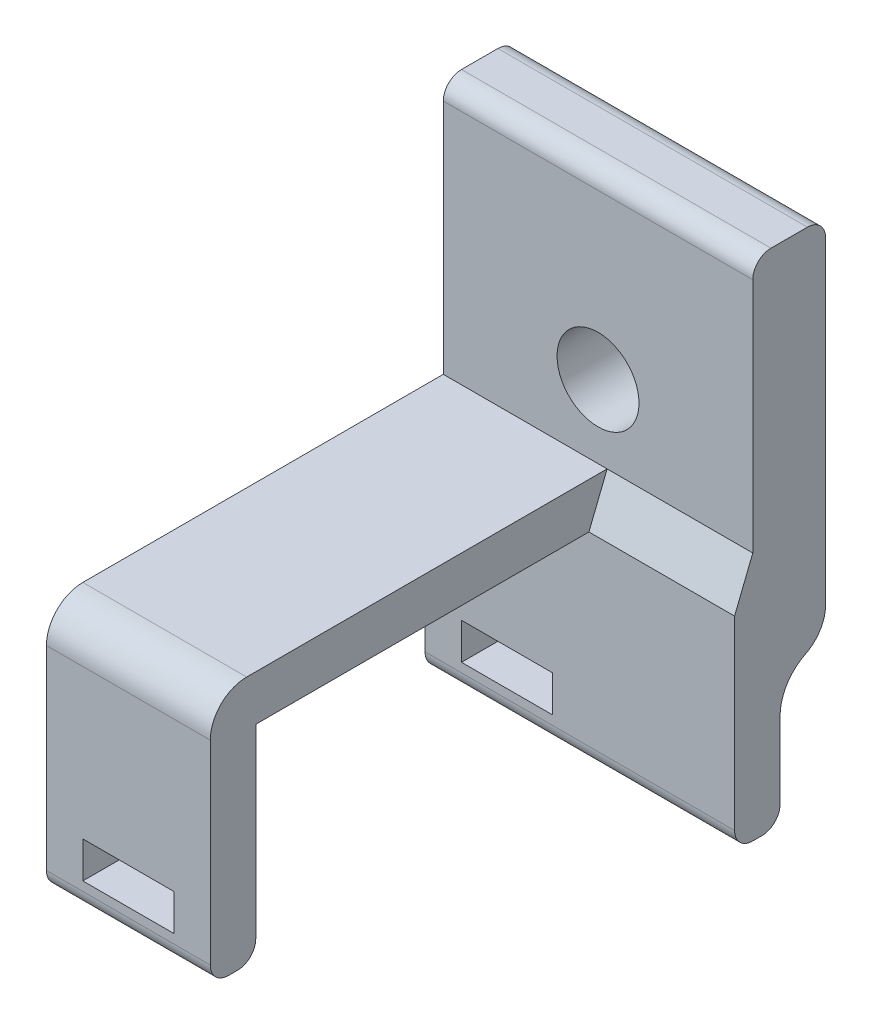
ISO-10303-21;
HEADER;
FILE_DESCRIPTION(('STEP AP214'),'2;1');
FILE_NAME('part.step','',(''),(''),'','','');
FILE_SCHEMA(('AUTOMOTIVE_DESIGN { 1 0 10303 214 1 1 1 1 }'));
ENDSEC;
DATA;
#1=APPLICATION_CONTEXT('core data for automotive mechanical design processes');
#2=APPLICATION_PROTOCOL_DEFINITION('international standard','automotive_design',2000,#1);
#3=PRODUCT_CONTEXT('',#1,'mechanical');
#4=PRODUCT('Part','Part','',(#3));
#5=PRODUCT_RELATED_PRODUCT_CATEGORY('part','',(#4));
#6=PRODUCT_DEFINITION_FORMATION('','',#4);
#7=PRODUCT_DEFINITION_CONTEXT('part definition',#1,'design');
#8=PRODUCT_DEFINITION('design','',#6,#7);
#9=PRODUCT_DEFINITION_SHAPE('','',#8);
#10=(LENGTH_UNIT() NAMED_UNIT(*) SI_UNIT(.MILLI.,.METRE.));
#11=(NAMED_UNIT(*) PLANE_ANGLE_UNIT() SI_UNIT($,.RADIAN.));
#12=(NAMED_UNIT(*) SI_UNIT($,.STERADIAN.) SOLID_ANGLE_UNIT());
#13=UNCERTAINTY_MEASURE_WITH_UNIT(LENGTH_MEASURE(1.E-05),#10,'distance_accuracy_value','');
#14=(GEOMETRIC_REPRESENTATION_CONTEXT(3) GLOBAL_UNCERTAINTY_ASSIGNED_CONTEXT((#13)) GLOBAL_UNIT_ASSIGNED_CONTEXT((#10,
#11,#12)) REPRESENTATION_CONTEXT('',''));
#15=CARTESIAN_POINT('',(0.,0.,0.));
#16=DIRECTION('',(0.,0.,1.));
#17=DIRECTION('',(1.,0.,0.));
#18=AXIS2_PLACEMENT_3D('',#15,#16,#17);
#19=CARTESIAN_POINT('',(4.5,-12.5,0.));
#20=DIRECTION('',(-1.,0.,0.));
#21=DIRECTION('',(0.,0.,1.));
#22=AXIS2_PLACEMENT_3D('',#19,#20,#21);
#23=PLANE('',#22);
#24=DIRECTION('',(0.,0.,1.));
#25=VECTOR('',#24,1.);
#26=CARTESIAN_POINT('',(4.5,-17.7000000177651,13.6433960420964));
#27=LINE('',#26,#25);
#28=CARTESIAN_POINT('',(4.5,-17.7000000177651,24.3000000000104));
#29=VERTEX_POINT('',#28);
#30=CARTESIAN_POINT('',(4.5,-17.7000000177651,24.8000000000104));
#31=VERTEX_POINT('',#30);
#32=EDGE_CURVE('E293',#29,#31,#27,.T.);
#33=ORIENTED_EDGE('',*,*,#32,.F.);
#34=CARTESIAN_POINT('',(4.5,-16.7000000177651,24.3000000000104));
#35=DIRECTION('',(-1.,0.,0.));
#36=DIRECTION('',(0.,0.,1.));
#37=AXIS2_PLACEMENT_3D('',#34,#35,#36);
#38=CIRCLE('',#37,1.);
#39=CARTESIAN_POINT('',(4.5,-16.7000000177651,23.3000000000104));
#40=VERTEX_POINT('',#39);
#41=EDGE_CURVE('E43',#29,#40,#38,.F.);
#42=ORIENTED_EDGE('',*,*,#41,.T.);
#43=DIRECTION('',(0.,1.,0.));
#44=VECTOR('',#43,1.);
#45=CARTESIAN_POINT('',(4.5,-14.2000000177651,23.3000000000104));
#46=LINE('',#45,#44);
#47=CARTESIAN_POINT('',(4.5,-6.50000000000001,23.3000000000104));
#48=VERTEX_POINT('',#47);
#49=EDGE_CURVE('E341',#40,#48,#46,.T.);
#50=ORIENTED_EDGE('',*,*,#49,.T.);
#51=DIRECTION('',(0.,0.,-1.));
#52=VECTOR('',#51,1.);
#53=CARTESIAN_POINT('',(4.5,-6.50000000000001,23.3000000000104));
#54=LINE('',#53,#52);
#55=CARTESIAN_POINT('',(4.5,-6.5,5.));
#56=VERTEX_POINT('',#55);
#57=EDGE_CURVE('E338',#48,#56,#54,.T.);
#58=ORIENTED_EDGE('',*,*,#57,.T.);
#59=DIRECTION('',(0.,-0.928476690885259,0.371390676354104));
#60=VECTOR('',#59,1.);
#61=CARTESIAN_POINT('',(4.5,-4.,4.));
#62=LINE('',#61,#60);
#63=CARTESIAN_POINT('',(4.5,-4.,4.));
#64=VERTEX_POINT('',#63);
#65=EDGE_CURVE('E305',#64,#56,#62,.T.);
#66=ORIENTED_EDGE('',*,*,#65,.F.);
#67=DIRECTION('',(0.,0.,-1.));
#68=VECTOR('',#67,1.);
#69=CARTESIAN_POINT('',(4.5,-4.00000000000001,25.8000000000104));
#70=LINE('',#69,#68);
#71=CARTESIAN_POINT('',(4.5,-4.00000000000001,23.8000000000104));
#72=VERTEX_POINT('',#71);
#73=EDGE_CURVE('E334',#72,#64,#70,.T.);
#74=ORIENTED_EDGE('',*,*,#73,.F.);
#75=CARTESIAN_POINT('',(4.5,-6.00000000000001,23.8000000000104));
#76=DIRECTION('',(-1.,0.,0.));
#77=DIRECTION('',(0.,0.,1.));
#78=AXIS2_PLACEMENT_3D('',#75,#76,#77);
#79=CIRCLE('',#78,2.);
#80=CARTESIAN_POINT('',(4.5,-6.00000000000001,25.8000000000104));
#81=VERTEX_POINT('',#80);
#82=EDGE_CURVE('E387',#72,#81,#79,.F.);
#83=ORIENTED_EDGE('',*,*,#82,.T.);
#84=DIRECTION('',(0.,1.,0.));
#85=VECTOR('',#84,1.);
#86=CARTESIAN_POINT('',(4.5,-14.2000000177651,25.8000000000104));
#87=LINE('',#86,#85);
#88=CARTESIAN_POINT('',(4.5,-16.7000000177651,25.8000000000104));
#89=VERTEX_POINT('',#88);
#90=EDGE_CURVE('E332',#89,#81,#87,.T.);
#91=ORIENTED_EDGE('',*,*,#90,.F.);
#92=CARTESIAN_POINT('',(4.5,-16.7000000177651,24.8000000000104));
#93=DIRECTION('',(-1.,0.,0.));
#94=DIRECTION('',(0.,0.,1.));
#95=AXIS2_PLACEMENT_3D('',#92,#93,#94);
#96=CIRCLE('',#95,1.);
#97=EDGE_CURVE('E50',#89,#31,#96,.F.);
#98=ORIENTED_EDGE('',*,*,#97,.T.);
#99=EDGE_LOOP('',(#33,#42,#50,#58,#66,#74,#83,#91,#98));
#100=FACE_BOUND('',#99,.T.);
#101=ADVANCED_FACE('F35',(#100),#23,.F.);
#102=CARTESIAN_POINT('',(4.5,-14.2000000177651,25.8000000000104));
#103=DIRECTION('',(0.,0.,1.));
#104=DIRECTION('',(0.,-1.,0.));
#105=AXIS2_PLACEMENT_3D('',#102,#103,#104);
#106=PLANE('',#105);
#107=DIRECTION('',(0.,1.,0.));
#108=VECTOR('',#107,1.);
#109=CARTESIAN_POINT('',(2.5,-16.2000000177651,25.8000000000104));
#110=LINE('',#109,#108);
#111=CARTESIAN_POINT('',(2.5,-16.2000000177651,25.8000000000104));
#112=VERTEX_POINT('',#111);
#113=CARTESIAN_POINT('',(2.5,-14.2000000177651,25.8000000000104));
#114=VERTEX_POINT('',#113);
#115=EDGE_CURVE('E248',#112,#114,#110,.T.);
#116=ORIENTED_EDGE('',*,*,#115,.F.);
#117=DIRECTION('',(1.,0.,0.));
#118=VECTOR('',#117,1.);
#119=CARTESIAN_POINT('',(-2.5,-16.2000000177651,25.8000000000104));
#120=LINE('',#119,#118);
#121=CARTESIAN_POINT('',(-2.5,-16.2000000177651,25.8000000000104));
#122=VERTEX_POINT('',#121);
#123=EDGE_CURVE('E253',#122,#112,#120,.T.);
#124=ORIENTED_EDGE('',*,*,#123,.F.);
#125=DIRECTION('',(0.,-1.,0.));
#126=VECTOR('',#125,1.);
#127=CARTESIAN_POINT('',(-2.5,-16.2000000177651,25.8000000000104));
#128=LINE('',#127,#126);
#129=CARTESIAN_POINT('',(-2.5,-14.2000000177651,25.8000000000104));
#130=VERTEX_POINT('',#129);
#131=EDGE_CURVE('E231',#130,#122,#128,.T.);
#132=ORIENTED_EDGE('',*,*,#131,.F.);
#133=DIRECTION('',(-1.,0.,0.));
#134=VECTOR('',#133,1.);
#135=CARTESIAN_POINT('',(-2.5,-14.2000000177651,25.8000000000104));
#136=LINE('',#135,#134);
#137=EDGE_CURVE('E242',#114,#130,#136,.T.);
#138=ORIENTED_EDGE('',*,*,#137,.F.);
#139=EDGE_LOOP('',(#116,#124,#132,#138));
#140=FACE_BOUND('',#139,.T.);
#141=DIRECTION('',(0.,1.,0.));
#142=VECTOR('',#141,1.);
#143=CARTESIAN_POINT('',(-4.5,-14.2000000177651,25.8000000000104));
#144=LINE('',#143,#142);
#145=CARTESIAN_POINT('',(-4.5,-16.7000000177651,25.8000000000104));
#146=VERTEX_POINT('',#145);
#147=CARTESIAN_POINT('',(-4.5,-6.00000000000001,25.8000000000104));
#148=VERTEX_POINT('',#147);
#149=EDGE_CURVE('E331',#146,#148,#144,.T.);
#150=ORIENTED_EDGE('',*,*,#149,.F.);
#151=DIRECTION('',(1.,0.,0.));
#152=VECTOR('',#151,1.);
#153=CARTESIAN_POINT('',(4.5,-16.7000000177651,25.8000000000104));
#154=LINE('',#153,#152);
#155=EDGE_CURVE('E11',#146,#89,#154,.T.);
#156=ORIENTED_EDGE('',*,*,#155,.T.);
#157=ORIENTED_EDGE('',*,*,#90,.T.);
#158=DIRECTION('',(-1.,0.,0.));
#159=VECTOR('',#158,1.);
#160=CARTESIAN_POINT('',(4.5,-6.00000000000001,25.8000000000104));
#161=LINE('',#160,#159);
#162=EDGE_CURVE('E390',#81,#148,#161,.T.);
#163=ORIENTED_EDGE('',*,*,#162,.T.);
#164=EDGE_LOOP('',(#150,#156,#157,#163));
#165=FACE_BOUND('',#164,.T.);
#166=ADVANCED_FACE('F250',(#140,#165),#106,.T.);
#167=CARTESIAN_POINT('',(4.5,-14.2000000177651,23.3000000000104));
#168=DIRECTION('',(0.,0.,1.));
#169=DIRECTION('',(0.,-1.,0.));
#170=AXIS2_PLACEMENT_3D('',#167,#168,#169);
#171=PLANE('',#170);
#172=DIRECTION('',(1.,0.,0.));
#173=VECTOR('',#172,1.);
#174=CARTESIAN_POINT('',(4.5,-16.2000000177651,23.3000000000104));
#175=LINE('',#174,#173);
#176=CARTESIAN_POINT('',(-2.5,-16.2000000177651,23.3000000000104));
#177=VERTEX_POINT('',#176);
#178=CARTESIAN_POINT('',(2.5,-16.2000000177651,23.3000000000104));
#179=VERTEX_POINT('',#178);
#180=EDGE_CURVE('E277',#177,#179,#175,.T.);
#181=ORIENTED_EDGE('',*,*,#180,.T.);
#182=DIRECTION('',(0.,1.,0.));
#183=VECTOR('',#182,1.);
#184=CARTESIAN_POINT('',(2.5,-14.2000000177651,23.3000000000104));
#185=LINE('',#184,#183);
#186=CARTESIAN_POINT('',(2.5,-14.2000000177651,23.3000000000104));
#187=VERTEX_POINT('',#186);
#188=EDGE_CURVE('E283',#179,#187,#185,.T.);
#189=ORIENTED_EDGE('',*,*,#188,.T.);
#190=DIRECTION('',(-1.,0.,0.));
#191=VECTOR('',#190,1.);
#192=CARTESIAN_POINT('',(4.5,-14.2000000177651,23.3000000000104));
#193=LINE('',#192,#191);
#194=CARTESIAN_POINT('',(-2.5,-14.2000000177651,23.3000000000104));
#195=VERTEX_POINT('',#194);
#196=EDGE_CURVE('E268',#187,#195,#193,.T.);
#197=ORIENTED_EDGE('',*,*,#196,.T.);
#198=DIRECTION('',(0.,-1.,0.));
#199=VECTOR('',#198,1.);
#200=CARTESIAN_POINT('',(-2.5,-14.2000000177651,23.3000000000104));
#201=LINE('',#200,#199);
#202=EDGE_CURVE('E234',#195,#177,#201,.T.);
#203=ORIENTED_EDGE('',*,*,#202,.T.);
#204=EDGE_LOOP('',(#181,#189,#197,#203));
#205=FACE_BOUND('',#204,.T.);
#206=ORIENTED_EDGE('',*,*,#49,.F.);
#207=DIRECTION('',(-1.,0.,0.));
#208=VECTOR('',#207,1.);
#209=CARTESIAN_POINT('',(-4.5,-16.7000000177651,23.3000000000104));
#210=LINE('',#209,#208);
#211=CARTESIAN_POINT('',(-4.5,-16.7000000177651,23.3000000000104));
#212=VERTEX_POINT('',#211);
#213=EDGE_CURVE('E449',#40,#212,#210,.T.);
#214=ORIENTED_EDGE('',*,*,#213,.T.);
#215=DIRECTION('',(0.,1.,0.));
#216=VECTOR('',#215,1.);
#217=CARTESIAN_POINT('',(-4.5,-14.2000000177651,23.3000000000104));
#218=LINE('',#217,#216);
#219=CARTESIAN_POINT('',(-4.5,-6.50000000000001,23.3000000000104));
#220=VERTEX_POINT('',#219);
#221=EDGE_CURVE('E335',#212,#220,#218,.T.);
#222=ORIENTED_EDGE('',*,*,#221,.T.);
#223=DIRECTION('',(-1.,0.,0.));
#224=VECTOR('',#223,1.);
#225=CARTESIAN_POINT('',(4.5,-6.50000000000001,23.3000000000104));
#226=LINE('',#225,#224);
#227=EDGE_CURVE('E367',#48,#220,#226,.T.);
#228=ORIENTED_EDGE('',*,*,#227,.F.);
#229=EDGE_LOOP('',(#206,#214,#222,#228));
#230=FACE_BOUND('',#229,.T.);
#231=ADVANCED_FACE('F463',(#205,#230),#171,.F.);
#232=CARTESIAN_POINT('',(4.5,-6.50000000000001,23.3000000000104));
#233=DIRECTION('',(0.,1.,0.));
#234=DIRECTION('',(0.,0.,1.));
#235=AXIS2_PLACEMENT_3D('',#232,#233,#234);
#236=PLANE('',#235);
#237=DIRECTION('',(0.,0.,-1.));
#238=VECTOR('',#237,1.);
#239=CARTESIAN_POINT('',(-4.5,-6.50000000000001,23.3000000000104));
#240=LINE('',#239,#238);
#241=CARTESIAN_POINT('',(-4.5,-6.5,5.));
#242=VERTEX_POINT('',#241);
#243=EDGE_CURVE('E364',#220,#242,#240,.T.);
#244=ORIENTED_EDGE('',*,*,#243,.T.);
#245=DIRECTION('',(-1.,0.,0.));
#246=VECTOR('',#245,1.);
#247=CARTESIAN_POINT('',(4.5,-6.5,5.));
#248=LINE('',#247,#246);
#249=EDGE_CURVE('E371',#56,#242,#248,.T.);
#250=ORIENTED_EDGE('',*,*,#249,.F.);
#251=ORIENTED_EDGE('',*,*,#57,.F.);
#252=ORIENTED_EDGE('',*,*,#227,.T.);
#253=EDGE_LOOP('',(#244,#250,#251,#252));
#254=FACE_BOUND('',#253,.T.);
#255=ADVANCED_FACE('F569',(#254),#236,.F.);
#256=CARTESIAN_POINT('',(4.5,-6.5,5.));
#257=DIRECTION('',(0.,0.,-1.));
#258=DIRECTION('',(0.,1.,0.));
#259=AXIS2_PLACEMENT_3D('',#256,#257,#258);
#260=PLANE('',#259);
#261=DIRECTION('',(1.,0.,0.));
#262=VECTOR('',#261,1.);
#263=CARTESIAN_POINT('',(4.5,-14.2000000177651,5.));
#264=LINE('',#263,#262);
#265=CARTESIAN_POINT('',(-2.5,-14.2000000177651,5.));
#266=VERTEX_POINT('',#265);
#267=CARTESIAN_POINT('',(2.5,-14.2000000177651,5.));
#268=VERTEX_POINT('',#267);
#269=EDGE_CURVE('E265',#266,#268,#264,.T.);
#270=ORIENTED_EDGE('',*,*,#269,.T.);
#271=DIRECTION('',(0.,-1.,0.));
#272=VECTOR('',#271,1.);
#273=CARTESIAN_POINT('',(2.5,-6.5,5.));
#274=LINE('',#273,#272);
#275=CARTESIAN_POINT('',(2.5,-16.2000000177651,5.));
#276=VERTEX_POINT('',#275);
#277=EDGE_CURVE('E280',#268,#276,#274,.T.);
#278=ORIENTED_EDGE('',*,*,#277,.T.);
#279=DIRECTION('',(-1.,0.,0.));
#280=VECTOR('',#279,1.);
#281=CARTESIAN_POINT('',(4.5,-16.2000000177651,5.));
#282=LINE('',#281,#280);
#283=CARTESIAN_POINT('',(-2.5,-16.2000000177651,5.));
#284=VERTEX_POINT('',#283);
#285=EDGE_CURVE('E274',#276,#284,#282,.T.);
#286=ORIENTED_EDGE('',*,*,#285,.T.);
#287=DIRECTION('',(0.,1.,0.));
#288=VECTOR('',#287,1.);
#289=CARTESIAN_POINT('',(-2.5,-6.5,5.));
#290=LINE('',#289,#288);
#291=EDGE_CURVE('E270',#284,#266,#290,.T.);
#292=ORIENTED_EDGE('',*,*,#291,.T.);
#293=EDGE_LOOP('',(#270,#278,#286,#292));
#294=FACE_BOUND('',#293,.T.);
#295=DIRECTION('',(0.,-1.,0.));
#296=VECTOR('',#295,1.);
#297=CARTESIAN_POINT('',(-4.5,-6.5,5.));
#298=LINE('',#297,#296);
#299=CARTESIAN_POINT('',(-4.5,-16.7000000177651,5.));
#300=VERTEX_POINT('',#299);
#301=EDGE_CURVE('E361',#242,#300,#298,.T.);
#302=ORIENTED_EDGE('',*,*,#301,.T.);
#303=DIRECTION('',(1.,0.,0.));
#304=VECTOR('',#303,1.);
#305=CARTESIAN_POINT('',(12.5,-16.7000000177651,5.));
#306=LINE('',#305,#304);
#307=CARTESIAN_POINT('',(12.5,-16.7000000177651,5.));
#308=VERTEX_POINT('',#307);
#309=EDGE_CURVE('E446',#300,#308,#306,.T.);
#310=ORIENTED_EDGE('',*,*,#309,.T.);
#311=DIRECTION('',(0.,-1.,0.));
#312=VECTOR('',#311,1.);
#313=CARTESIAN_POINT('',(12.5,-6.5,5.));
#314=LINE('',#313,#312);
#315=CARTESIAN_POINT('',(12.5,-6.5,5.));
#316=VERTEX_POINT('',#315);
#317=EDGE_CURVE('E315',#316,#308,#314,.T.);
#318=ORIENTED_EDGE('',*,*,#317,.F.);
#319=DIRECTION('',(-1.,0.,0.));
#320=VECTOR('',#319,1.);
#321=CARTESIAN_POINT('',(12.5,-6.5,5.));
#322=LINE('',#321,#320);
#323=EDGE_CURVE('E323',#316,#56,#322,.T.);
#324=ORIENTED_EDGE('',*,*,#323,.T.);
#325=ORIENTED_EDGE('',*,*,#249,.T.);
#326=EDGE_LOOP('',(#302,#310,#318,#324,#325));
#327=FACE_BOUND('',#326,.T.);
#328=ADVANCED_FACE('F510',(#294,#327),#260,.F.);
#329=CARTESIAN_POINT('',(4.5,-14.2000000177651,2.5));
#330=DIRECTION('',(0.,0.,1.));
#331=DIRECTION('',(0.,-1.,0.));
#332=AXIS2_PLACEMENT_3D('',#329,#330,#331);
#333=PLANE('',#332);
#334=DIRECTION('',(1.,0.,0.));
#335=VECTOR('',#334,1.);
#336=CARTESIAN_POINT('',(4.5,-16.2000000177651,2.5));
#337=LINE('',#336,#335);
#338=CARTESIAN_POINT('',(-2.5,-16.2000000177651,2.5));
#339=VERTEX_POINT('',#338);
#340=CARTESIAN_POINT('',(2.5,-16.2000000177651,2.5));
#341=VERTEX_POINT('',#340);
#342=EDGE_CURVE('E403',#339,#341,#337,.T.);
#343=ORIENTED_EDGE('',*,*,#342,.T.);
#344=DIRECTION('',(0.,1.,0.));
#345=VECTOR('',#344,1.);
#346=CARTESIAN_POINT('',(2.5,-14.2000000177651,2.5));
#347=LINE('',#346,#345);
#348=CARTESIAN_POINT('',(2.5,-14.2000000177651,2.5));
#349=VERTEX_POINT('',#348);
#350=EDGE_CURVE('E406',#341,#349,#347,.T.);
#351=ORIENTED_EDGE('',*,*,#350,.T.);
#352=DIRECTION('',(-1.,0.,0.));
#353=VECTOR('',#352,1.);
#354=CARTESIAN_POINT('',(4.5,-14.2000000177651,2.5));
#355=LINE('',#354,#353);
#356=CARTESIAN_POINT('',(-2.5,-14.2000000177651,2.5));
#357=VERTEX_POINT('',#356);
#358=EDGE_CURVE('E395',#349,#357,#355,.T.);
#359=ORIENTED_EDGE('',*,*,#358,.T.);
#360=DIRECTION('',(0.,-1.,0.));
#361=VECTOR('',#360,1.);
#362=CARTESIAN_POINT('',(-2.5,-14.2000000177651,2.5));
#363=LINE('',#362,#361);
#364=EDGE_CURVE('E400',#357,#339,#363,.T.);
#365=ORIENTED_EDGE('',*,*,#364,.T.);
#366=EDGE_LOOP('',(#343,#351,#359,#365));
#367=FACE_BOUND('',#366,.T.);
#368=DIRECTION('',(0.,1.,0.));
#369=VECTOR('',#368,1.);
#370=CARTESIAN_POINT('',(12.5,-14.2000000177651,2.5));
#371=LINE('',#370,#369);
#372=CARTESIAN_POINT('',(12.5,-16.7000000177651,2.5));
#373=VERTEX_POINT('',#372);
#374=CARTESIAN_POINT('',(12.5,-12.5,2.5));
#375=VERTEX_POINT('',#374);
#376=EDGE_CURVE('E318',#373,#375,#371,.T.);
#377=ORIENTED_EDGE('',*,*,#376,.F.);
#378=DIRECTION('',(-1.,0.,0.));
#379=VECTOR('',#378,1.);
#380=CARTESIAN_POINT('',(-4.5,-16.7000000177651,2.5));
#381=LINE('',#380,#379);
#382=CARTESIAN_POINT('',(-4.5,-16.7000000177651,2.5));
#383=VERTEX_POINT('',#382);
#384=EDGE_CURVE('E439',#373,#383,#381,.T.);
#385=ORIENTED_EDGE('',*,*,#384,.T.);
#386=DIRECTION('',(0.,1.,0.));
#387=VECTOR('',#386,1.);
#388=CARTESIAN_POINT('',(-4.5,-14.2000000177651,2.5));
#389=LINE('',#388,#387);
#390=CARTESIAN_POINT('',(-4.5,-12.5,2.5));
#391=VERTEX_POINT('',#390);
#392=EDGE_CURVE('E359',#383,#391,#389,.T.);
#393=ORIENTED_EDGE('',*,*,#392,.T.);
#394=DIRECTION('',(-1.,0.,0.));
#395=VECTOR('',#394,1.);
#396=CARTESIAN_POINT('',(4.5,-12.5,2.5));
#397=LINE('',#396,#395);
#398=EDGE_CURVE('E374',#375,#391,#397,.T.);
#399=ORIENTED_EDGE('',*,*,#398,.F.);
#400=EDGE_LOOP('',(#377,#385,#393,#399));
#401=FACE_BOUND('',#400,.T.);
#402=ADVANCED_FACE('F529',(#367,#401),#333,.F.);
#403=CARTESIAN_POINT('',(4.5,-12.5,0.));
#404=DIRECTION('',(-1.,0.,0.));
#405=DIRECTION('',(0.,0.,1.));
#406=AXIS2_PLACEMENT_3D('',#403,#404,#405);
#407=CYLINDRICAL_SURFACE('',#406,2.5);
#408=CARTESIAN_POINT('',(-4.5,-12.5,0.));
#409=DIRECTION('',(-1.,0.,0.));
#410=DIRECTION('',(0.,0.,1.));
#411=AXIS2_PLACEMENT_3D('',#408,#409,#410);
#412=CIRCLE('',#411,2.5);
#413=CARTESIAN_POINT('',(-4.5,-10.260483958806,1.11111111111111));
#414=VERTEX_POINT('',#413);
#415=EDGE_CURVE('E356',#391,#414,#412,.T.);
#416=ORIENTED_EDGE('',*,*,#415,.T.);
#417=DIRECTION('',(-1.,0.,0.));
#418=VECTOR('',#417,1.);
#419=CARTESIAN_POINT('',(4.5,-10.260483958806,1.11111111111111));
#420=LINE('',#419,#418);
#421=CARTESIAN_POINT('',(12.5,-10.260483958806,1.11111111111111));
#422=VERTEX_POINT('',#421);
#423=EDGE_CURVE('E385',#414,#422,#420,.F.);
#424=ORIENTED_EDGE('',*,*,#423,.T.);
#425=CARTESIAN_POINT('',(12.5,-12.5,0.));
#426=DIRECTION('',(-1.,0.,0.));
#427=DIRECTION('',(0.,0.,-1.));
#428=AXIS2_PLACEMENT_3D('',#425,#426,#427);
#429=CIRCLE('',#428,2.5);
#430=EDGE_CURVE('E320',#375,#422,#429,.T.);
#431=ORIENTED_EDGE('',*,*,#430,.F.);
#432=ORIENTED_EDGE('',*,*,#398,.T.);
#433=EDGE_LOOP('',(#416,#424,#431,#432));
#434=FACE_BOUND('',#433,.T.);
#435=ADVANCED_FACE('F545',(#434),#407,.F.);
#436=CARTESIAN_POINT('',(4.5,-10.,0.));
#437=DIRECTION('',(0.,0.,1.));
#438=DIRECTION('',(1.,0.,0.));
#439=AXIS2_PLACEMENT_3D('',#436,#437,#438);
#440=PLANE('',#439);
#441=CARTESIAN_POINT('',(4.,0.,0.));
#442=DIRECTION('',(0.,0.,-1.));
#443=DIRECTION('',(-1.,0.,0.));
#444=AXIS2_PLACEMENT_3D('',#441,#442,#443);
#445=CIRCLE('',#444,2.24999999999999);
#446=CARTESIAN_POINT('',(1.75000000000001,0.,0.));
#447=VERTEX_POINT('',#446);
#448=EDGE_CURVE('E295',#447,#447,#445,.T.);
#449=ORIENTED_EDGE('',*,*,#448,.F.);
#450=EDGE_LOOP('',(#449));
#451=FACE_BOUND('',#450,.T.);
#452=DIRECTION('',(0.,1.,0.));
#453=VECTOR('',#452,1.);
#454=CARTESIAN_POINT('',(-4.5,-10.,0.));
#455=LINE('',#454,#453);
#456=CARTESIAN_POINT('',(-4.5,-8.46887112585073,0.));
#457=VERTEX_POINT('',#456);
#458=CARTESIAN_POINT('',(-4.5,9.,0.));
#459=VERTEX_POINT('',#458);
#460=EDGE_CURVE('E353',#457,#459,#455,.T.);
#461=ORIENTED_EDGE('',*,*,#460,.T.);
#462=DIRECTION('',(-1.,0.,0.));
#463=VECTOR('',#462,1.);
#464=CARTESIAN_POINT('',(12.5,9.,0.));
#465=LINE('',#464,#463);
#466=CARTESIAN_POINT('',(12.5,9.,0.));
#467=VERTEX_POINT('',#466);
#468=EDGE_CURVE('E426',#459,#467,#465,.F.);
#469=ORIENTED_EDGE('',*,*,#468,.T.);
#470=DIRECTION('',(0.,1.,0.));
#471=VECTOR('',#470,1.);
#472=CARTESIAN_POINT('',(12.5,-8.46887112585073,0.));
#473=LINE('',#472,#471);
#474=CARTESIAN_POINT('',(12.5,-8.46887112585073,0.));
#475=VERTEX_POINT('',#474);
#476=EDGE_CURVE('E304',#475,#467,#473,.T.);
#477=ORIENTED_EDGE('',*,*,#476,.F.);
#478=DIRECTION('',(-1.,0.,0.));
#479=VECTOR('',#478,1.);
#480=CARTESIAN_POINT('',(4.5,-8.46887112585073,0.));
#481=LINE('',#480,#479);
#482=EDGE_CURVE('E370',#475,#457,#481,.T.);
#483=ORIENTED_EDGE('',*,*,#482,.T.);
#484=EDGE_LOOP('',(#461,#469,#477,#483));
#485=FACE_BOUND('',#484,.T.);
#486=ADVANCED_FACE('F540',(#451,#485),#440,.F.);
#487=CARTESIAN_POINT('',(4.5,10.,4.));
#488=DIRECTION('',(0.,1.,0.));
#489=DIRECTION('',(0.,0.,1.));
#490=AXIS2_PLACEMENT_3D('',#487,#488,#489);
#491=PLANE('',#490);
#492=DIRECTION('',(0.,0.,1.));
#493=VECTOR('',#492,1.);
#494=CARTESIAN_POINT('',(12.5,10.,0.));
#495=LINE('',#494,#493);
#496=CARTESIAN_POINT('',(12.5,10.,1.));
#497=VERTEX_POINT('',#496);
#498=CARTESIAN_POINT('',(12.5,10.,3.));
#499=VERTEX_POINT('',#498);
#500=EDGE_CURVE('E308',#497,#499,#495,.T.);
#501=ORIENTED_EDGE('',*,*,#500,.F.);
#502=DIRECTION('',(-1.,0.,0.));
#503=VECTOR('',#502,1.);
#504=CARTESIAN_POINT('',(-4.5,10.,1.));
#505=LINE('',#504,#503);
#506=CARTESIAN_POINT('',(-4.5,10.,1.));
#507=VERTEX_POINT('',#506);
#508=EDGE_CURVE('E411',#497,#507,#505,.T.);
#509=ORIENTED_EDGE('',*,*,#508,.T.);
#510=DIRECTION('',(0.,0.,-1.));
#511=VECTOR('',#510,1.);
#512=CARTESIAN_POINT('',(-4.5,10.,4.));
#513=LINE('',#512,#511);
#514=CARTESIAN_POINT('',(-4.5,10.,3.));
#515=VERTEX_POINT('',#514);
#516=EDGE_CURVE('E350',#515,#507,#513,.T.);
#517=ORIENTED_EDGE('',*,*,#516,.F.);
#518=DIRECTION('',(-1.,0.,0.));
#519=VECTOR('',#518,1.);
#520=CARTESIAN_POINT('',(4.5,10.,3.));
#521=LINE('',#520,#519);
#522=EDGE_CURVE('E409',#515,#499,#521,.F.);
#523=ORIENTED_EDGE('',*,*,#522,.T.);
#524=EDGE_LOOP('',(#501,#509,#517,#523));
#525=FACE_BOUND('',#524,.T.);
#526=ADVANCED_FACE('F497',(#525),#491,.T.);
#527=CARTESIAN_POINT('',(4.5,-4.,4.));
#528=DIRECTION('',(0.,0.,1.));
#529=DIRECTION('',(1.,0.,0.));
#530=AXIS2_PLACEMENT_3D('',#527,#528,#529);
#531=PLANE('',#530);
#532=CARTESIAN_POINT('',(4.,0.,4.));
#533=DIRECTION('',(0.,0.,1.));
#534=DIRECTION('',(1.,0.,0.));
#535=AXIS2_PLACEMENT_3D('',#532,#533,#534);
#536=CIRCLE('',#535,2.24999999999999);
#537=CARTESIAN_POINT('',(6.24999999999999,0.,4.));
#538=VERTEX_POINT('',#537);
#539=EDGE_CURVE('E300',#538,#538,#536,.T.);
#540=ORIENTED_EDGE('',*,*,#539,.F.);
#541=EDGE_LOOP('',(#540));
#542=FACE_BOUND('',#541,.T.);
#543=DIRECTION('',(0.,-1.,0.));
#544=VECTOR('',#543,1.);
#545=CARTESIAN_POINT('',(12.5,10.,4.));
#546=LINE('',#545,#544);
#547=CARTESIAN_POINT('',(12.5,9.,4.));
#548=VERTEX_POINT('',#547);
#549=CARTESIAN_POINT('',(12.5,-4.,4.));
#550=VERTEX_POINT('',#549);
#551=EDGE_CURVE('E311',#548,#550,#546,.T.);
#552=ORIENTED_EDGE('',*,*,#551,.F.);
#553=DIRECTION('',(-1.,0.,0.));
#554=VECTOR('',#553,1.);
#555=CARTESIAN_POINT('',(4.5,9.,4.));
#556=LINE('',#555,#554);
#557=CARTESIAN_POINT('',(-4.5,9.,4.));
#558=VERTEX_POINT('',#557);
#559=EDGE_CURVE('E436',#548,#558,#556,.T.);
#560=ORIENTED_EDGE('',*,*,#559,.T.);
#561=DIRECTION('',(0.,1.,0.));
#562=VECTOR('',#561,1.);
#563=CARTESIAN_POINT('',(-4.5,-4.,4.));
#564=LINE('',#563,#562);
#565=CARTESIAN_POINT('',(-4.5,-4.,4.));
#566=VERTEX_POINT('',#565);
#567=EDGE_CURVE('E347',#566,#558,#564,.T.);
#568=ORIENTED_EDGE('',*,*,#567,.F.);
#569=DIRECTION('',(-1.,0.,0.));
#570=VECTOR('',#569,1.);
#571=CARTESIAN_POINT('',(4.5,-4.,4.));
#572=LINE('',#571,#570);
#573=EDGE_CURVE('E343',#64,#566,#572,.T.);
#574=ORIENTED_EDGE('',*,*,#573,.F.);
#575=DIRECTION('',(-1.,0.,0.));
#576=VECTOR('',#575,1.);
#577=CARTESIAN_POINT('',(12.5,-4.,4.));
#578=LINE('',#577,#576);
#579=EDGE_CURVE('E328',#550,#64,#578,.T.);
#580=ORIENTED_EDGE('',*,*,#579,.F.);
#581=EDGE_LOOP('',(#552,#560,#568,#574,#580));
#582=FACE_BOUND('',#581,.T.);
#583=ADVANCED_FACE('F490',(#542,#582),#531,.T.);
#584=CARTESIAN_POINT('',(4.5,-4.00000000000001,25.8000000000104));
#585=DIRECTION('',(0.,1.,0.));
#586=DIRECTION('',(0.,0.,1.));
#587=AXIS2_PLACEMENT_3D('',#584,#585,#586);
#588=PLANE('',#587);
#589=DIRECTION('',(0.,0.,-1.));
#590=VECTOR('',#589,1.);
#591=CARTESIAN_POINT('',(-4.5,-4.00000000000001,25.8000000000104));
#592=LINE('',#591,#590);
#593=CARTESIAN_POINT('',(-4.5,-4.00000000000001,23.8000000000104));
#594=VERTEX_POINT('',#593);
#595=EDGE_CURVE('E345',#594,#566,#592,.T.);
#596=ORIENTED_EDGE('',*,*,#595,.F.);
#597=DIRECTION('',(-1.,0.,0.));
#598=VECTOR('',#597,1.);
#599=CARTESIAN_POINT('',(4.5,-4.00000000000001,23.8000000000104));
#600=LINE('',#599,#598);
#601=EDGE_CURVE('E393',#594,#72,#600,.F.);
#602=ORIENTED_EDGE('',*,*,#601,.T.);
#603=ORIENTED_EDGE('',*,*,#73,.T.);
#604=ORIENTED_EDGE('',*,*,#573,.T.);
#605=EDGE_LOOP('',(#596,#602,#603,#604));
#606=FACE_BOUND('',#605,.T.);
#607=ADVANCED_FACE('F483',(#606),#588,.T.);
#608=CARTESIAN_POINT('',(-4.5,-12.5,0.));
#609=DIRECTION('',(-1.,0.,0.));
#610=DIRECTION('',(0.,0.,1.));
#611=AXIS2_PLACEMENT_3D('',#608,#609,#610);
#612=PLANE('',#611);
#613=ORIENTED_EDGE('',*,*,#516,.T.);
#614=CARTESIAN_POINT('',(-4.5,9.,1.));
#615=DIRECTION('',(-1.,0.,0.));
#616=DIRECTION('',(0.,0.,1.));
#617=AXIS2_PLACEMENT_3D('',#614,#615,#616);
#618=CIRCLE('',#617,1.);
#619=EDGE_CURVE('E424',#507,#459,#618,.T.);
#620=ORIENTED_EDGE('',*,*,#619,.T.);
#621=ORIENTED_EDGE('',*,*,#460,.F.);
#622=CARTESIAN_POINT('',(-4.5,-8.46887112585073,2.));
#623=DIRECTION('',(-1.,0.,0.));
#624=DIRECTION('',(0.,0.,1.));
#625=AXIS2_PLACEMENT_3D('',#622,#623,#624);
#626=CIRCLE('',#625,2.);
#627=EDGE_CURVE('E383',#457,#414,#626,.T.);
#628=ORIENTED_EDGE('',*,*,#627,.T.);
#629=ORIENTED_EDGE('',*,*,#415,.F.);
#630=ORIENTED_EDGE('',*,*,#392,.F.);
#631=CARTESIAN_POINT('',(-4.5,-16.7000000177651,3.5));
#632=DIRECTION('',(-1.,0.,0.));
#633=DIRECTION('',(0.,0.,1.));
#634=AXIS2_PLACEMENT_3D('',#631,#632,#633);
#635=CIRCLE('',#634,1.);
#636=CARTESIAN_POINT('',(-4.5,-17.7000000177651,3.49999999999999));
#637=VERTEX_POINT('',#636);
#638=EDGE_CURVE('E420',#383,#637,#635,.T.);
#639=ORIENTED_EDGE('',*,*,#638,.T.);
#640=DIRECTION('',(0.,0.,1.));
#641=VECTOR('',#640,1.);
#642=CARTESIAN_POINT('',(-4.5,-17.7000000177651,-14.8565549577098));
#643=LINE('',#642,#641);
#644=CARTESIAN_POINT('',(-4.5,-17.7000000177651,3.99999999999999));
#645=VERTEX_POINT('',#644);
#646=EDGE_CURVE('E286',#637,#645,#643,.T.);
#647=ORIENTED_EDGE('',*,*,#646,.T.);
#648=CARTESIAN_POINT('',(-4.5,-16.7000000177651,4.));
#649=DIRECTION('',(-1.,0.,0.));
#650=DIRECTION('',(0.,0.,1.));
#651=AXIS2_PLACEMENT_3D('',#648,#649,#650);
#652=CIRCLE('',#651,1.);
#653=EDGE_CURVE('E418',#645,#300,#652,.T.);
#654=ORIENTED_EDGE('',*,*,#653,.T.);
#655=ORIENTED_EDGE('',*,*,#301,.F.);
#656=ORIENTED_EDGE('',*,*,#243,.F.);
#657=ORIENTED_EDGE('',*,*,#221,.F.);
#658=CARTESIAN_POINT('',(-4.5,-16.7000000177651,24.3000000000104));
#659=DIRECTION('',(-1.,0.,0.));
#660=DIRECTION('',(0.,0.,1.));
#661=AXIS2_PLACEMENT_3D('',#658,#659,#660);
#662=CIRCLE('',#661,1.);
#663=CARTESIAN_POINT('',(-4.5,-17.7000000177651,24.3000000000104));
#664=VERTEX_POINT('',#663);
#665=EDGE_CURVE('E416',#212,#664,#662,.T.);
#666=ORIENTED_EDGE('',*,*,#665,.T.);
#667=DIRECTION('',(0.,0.,1.));
#668=VECTOR('',#667,1.);
#669=CARTESIAN_POINT('',(-4.5,-17.7000000177651,13.6433960420964));
#670=LINE('',#669,#668);
#671=CARTESIAN_POINT('',(-4.5,-17.7000000177651,24.8000000000104));
#672=VERTEX_POINT('',#671);
#673=EDGE_CURVE('E290',#664,#672,#670,.T.);
#674=ORIENTED_EDGE('',*,*,#673,.T.);
#675=CARTESIAN_POINT('',(-4.5,-16.7000000177651,24.8000000000104));
#676=DIRECTION('',(-1.,0.,0.));
#677=DIRECTION('',(0.,0.,1.));
#678=AXIS2_PLACEMENT_3D('',#675,#676,#677);
#679=CIRCLE('',#678,1.);
#680=EDGE_CURVE('E414',#672,#146,#679,.T.);
#681=ORIENTED_EDGE('',*,*,#680,.T.);
#682=ORIENTED_EDGE('',*,*,#149,.T.);
#683=CARTESIAN_POINT('',(-4.5,-6.00000000000001,23.8000000000104));
#684=DIRECTION('',(-1.,0.,0.));
#685=DIRECTION('',(0.,0.,1.));
#686=AXIS2_PLACEMENT_3D('',#683,#684,#685);
#687=CIRCLE('',#686,2.);
#688=EDGE_CURVE('E381',#148,#594,#687,.T.);
#689=ORIENTED_EDGE('',*,*,#688,.T.);
#690=ORIENTED_EDGE('',*,*,#595,.T.);
#691=ORIENTED_EDGE('',*,*,#567,.T.);
#692=CARTESIAN_POINT('',(-4.5,9.,3.));
#693=DIRECTION('',(-1.,0.,0.));
#694=DIRECTION('',(0.,0.,1.));
#695=AXIS2_PLACEMENT_3D('',#692,#693,#694);
#696=CIRCLE('',#695,1.);
#697=EDGE_CURVE('E422',#558,#515,#696,.T.);
#698=ORIENTED_EDGE('',*,*,#697,.T.);
#699=EDGE_LOOP('',(#613,#620,#621,#628,#629,#630,#639,#647,#654,#655,#656,#657,#666,#674,#681,
#682,#689,#690,#691,#698));
#700=FACE_BOUND('',#699,.T.);
#701=ADVANCED_FACE('F469',(#700),#612,.T.);
#702=CARTESIAN_POINT('',(4.5,-8.46887112585073,2.));
#703=DIRECTION('',(-1.,0.,0.));
#704=DIRECTION('',(0.,0.,1.));
#705=AXIS2_PLACEMENT_3D('',#702,#703,#704);
#706=CYLINDRICAL_SURFACE('',#705,2.);
#707=ORIENTED_EDGE('',*,*,#482,.F.);
#708=CARTESIAN_POINT('',(12.5,-8.46887112585073,2.));
#709=DIRECTION('',(1.,0.,0.));
#710=DIRECTION('',(0.,0.,-1.));
#711=AXIS2_PLACEMENT_3D('',#708,#709,#710);
#712=CIRCLE('',#711,2.);
#713=EDGE_CURVE('E301',#422,#475,#712,.T.);
#714=ORIENTED_EDGE('',*,*,#713,.F.);
#715=ORIENTED_EDGE('',*,*,#423,.F.);
#716=ORIENTED_EDGE('',*,*,#627,.F.);
#717=EDGE_LOOP('',(#707,#714,#715,#716));
#718=FACE_BOUND('',#717,.T.);
#719=ADVANCED_FACE('F536',(#718),#706,.T.);
#720=CARTESIAN_POINT('',(4.5,-6.00000000000001,23.8000000000104));
#721=DIRECTION('',(-1.,0.,0.));
#722=DIRECTION('',(0.,0.,1.));
#723=AXIS2_PLACEMENT_3D('',#720,#721,#722);
#724=CYLINDRICAL_SURFACE('',#723,2.);
#725=ORIENTED_EDGE('',*,*,#82,.F.);
#726=ORIENTED_EDGE('',*,*,#601,.F.);
#727=ORIENTED_EDGE('',*,*,#688,.F.);
#728=ORIENTED_EDGE('',*,*,#162,.F.);
#729=EDGE_LOOP('',(#725,#726,#727,#728));
#730=FACE_BOUND('',#729,.T.);
#731=ADVANCED_FACE('F479',(#730),#724,.T.);
#732=CARTESIAN_POINT('',(12.5,-4.,4.));
#733=DIRECTION('',(0.,-0.371390676354104,-0.928476690885259));
#734=DIRECTION('',(0.,0.928476690885259,-0.371390676354104));
#735=AXIS2_PLACEMENT_3D('',#732,#733,#734);
#736=PLANE('',#735);
#737=ORIENTED_EDGE('',*,*,#65,.T.);
#738=ORIENTED_EDGE('',*,*,#323,.F.);
#739=DIRECTION('',(0.,-0.928476690885259,0.371390676354104));
#740=VECTOR('',#739,1.);
#741=CARTESIAN_POINT('',(12.5,-4.,4.));
#742=LINE('',#741,#740);
#743=EDGE_CURVE('E313',#550,#316,#742,.T.);
#744=ORIENTED_EDGE('',*,*,#743,.F.);
#745=ORIENTED_EDGE('',*,*,#579,.T.);
#746=EDGE_LOOP('',(#737,#738,#744,#745));
#747=FACE_BOUND('',#746,.T.);
#748=ADVANCED_FACE('F506',(#747),#736,.F.);
#749=CARTESIAN_POINT('',(12.5,-8.46887112585073,2.));
#750=DIRECTION('',(1.,0.,0.));
#751=DIRECTION('',(0.,0.,-1.));
#752=AXIS2_PLACEMENT_3D('',#749,#750,#751);
#753=PLANE('',#752);
#754=ORIENTED_EDGE('',*,*,#476,.T.);
#755=CARTESIAN_POINT('',(12.5,9.,1.));
#756=DIRECTION('',(1.,0.,0.));
#757=DIRECTION('',(0.,0.,-1.));
#758=AXIS2_PLACEMENT_3D('',#755,#756,#757);
#759=CIRCLE('',#758,1.);
#760=EDGE_CURVE('E434',#467,#497,#759,.T.);
#761=ORIENTED_EDGE('',*,*,#760,.T.);
#762=ORIENTED_EDGE('',*,*,#500,.T.);
#763=CARTESIAN_POINT('',(12.5,9.,3.));
#764=DIRECTION('',(1.,0.,0.));
#765=DIRECTION('',(0.,0.,-1.));
#766=AXIS2_PLACEMENT_3D('',#763,#764,#765);
#767=CIRCLE('',#766,1.);
#768=EDGE_CURVE('E432',#499,#548,#767,.T.);
#769=ORIENTED_EDGE('',*,*,#768,.T.);
#770=ORIENTED_EDGE('',*,*,#551,.T.);
#771=ORIENTED_EDGE('',*,*,#743,.T.);
#772=ORIENTED_EDGE('',*,*,#317,.T.);
#773=CARTESIAN_POINT('',(12.5,-16.7000000177651,4.));
#774=DIRECTION('',(1.,0.,0.));
#775=DIRECTION('',(0.,0.,-1.));
#776=AXIS2_PLACEMENT_3D('',#773,#774,#775);
#777=CIRCLE('',#776,1.);
#778=CARTESIAN_POINT('',(12.5,-17.7000000177651,3.99999999999999));
#779=VERTEX_POINT('',#778);
#780=EDGE_CURVE('E428',#308,#779,#777,.T.);
#781=ORIENTED_EDGE('',*,*,#780,.T.);
#782=DIRECTION('',(0.,0.,1.));
#783=VECTOR('',#782,1.);
#784=CARTESIAN_POINT('',(12.5,-17.7000000177651,-14.8565549577098));
#785=LINE('',#784,#783);
#786=CARTESIAN_POINT('',(12.5,-17.7000000177651,3.49999999999999));
#787=VERTEX_POINT('',#786);
#788=EDGE_CURVE('E287',#787,#779,#785,.T.);
#789=ORIENTED_EDGE('',*,*,#788,.F.);
#790=CARTESIAN_POINT('',(12.5,-16.7000000177651,3.5));
#791=DIRECTION('',(1.,0.,0.));
#792=DIRECTION('',(0.,0.,-1.));
#793=AXIS2_PLACEMENT_3D('',#790,#791,#792);
#794=CIRCLE('',#793,1.);
#795=EDGE_CURVE('E430',#787,#373,#794,.T.);
#796=ORIENTED_EDGE('',*,*,#795,.T.);
#797=ORIENTED_EDGE('',*,*,#376,.T.);
#798=ORIENTED_EDGE('',*,*,#430,.T.);
#799=ORIENTED_EDGE('',*,*,#713,.T.);
#800=EDGE_LOOP('',(#754,#761,#762,#769,#770,#771,#772,#781,#789,#796,#797,#798,#799));
#801=FACE_BOUND('',#800,.T.);
#802=ADVANCED_FACE('F502',(#801),#753,.T.);
#803=CARTESIAN_POINT('',(4.,0.,0.));
#804=DIRECTION('',(0.,0.,-1.));
#805=DIRECTION('',(-1.,0.,0.));
#806=AXIS2_PLACEMENT_3D('',#803,#804,#805);
#807=CYLINDRICAL_SURFACE('',#806,2.24999999999999);
#808=ORIENTED_EDGE('',*,*,#539,.T.);
#809=EDGE_LOOP('',(#808));
#810=FACE_BOUND('',#809,.T.);
#811=ORIENTED_EDGE('',*,*,#448,.T.);
#812=EDGE_LOOP('',(#811));
#813=FACE_BOUND('',#812,.T.);
#814=ADVANCED_FACE('F620',(#810,#813),#807,.F.);
#815=CARTESIAN_POINT('',(-4.5,-17.7000000177651,13.6433960420964));
#816=DIRECTION('',(0.,-1.,0.));
#817=DIRECTION('',(0.,0.,-1.));
#818=AXIS2_PLACEMENT_3D('',#815,#816,#817);
#819=PLANE('',#818);
#820=ORIENTED_EDGE('',*,*,#673,.F.);
#821=DIRECTION('',(-1.,0.,0.));
#822=VECTOR('',#821,1.);
#823=CARTESIAN_POINT('',(4.5,-17.7000000177651,24.3000000000104));
#824=LINE('',#823,#822);
#825=EDGE_CURVE('E454',#664,#29,#824,.F.);
#826=ORIENTED_EDGE('',*,*,#825,.T.);
#827=ORIENTED_EDGE('',*,*,#32,.T.);
#828=DIRECTION('',(1.,0.,0.));
#829=VECTOR('',#828,1.);
#830=CARTESIAN_POINT('',(-4.5,-17.7000000177651,24.8000000000104));
#831=LINE('',#830,#829);
#832=EDGE_CURVE('E452',#31,#672,#831,.F.);
#833=ORIENTED_EDGE('',*,*,#832,.T.);
#834=EDGE_LOOP('',(#820,#826,#827,#833));
#835=FACE_BOUND('',#834,.T.);
#836=ADVANCED_FACE('F473',(#835),#819,.T.);
#837=CARTESIAN_POINT('',(-4.5,-17.7000000177651,-14.8565549577098));
#838=DIRECTION('',(0.,-1.,0.));
#839=DIRECTION('',(0.,0.,-1.));
#840=AXIS2_PLACEMENT_3D('',#837,#838,#839);
#841=PLANE('',#840);
#842=ORIENTED_EDGE('',*,*,#646,.F.);
#843=DIRECTION('',(-1.,0.,0.));
#844=VECTOR('',#843,1.);
#845=CARTESIAN_POINT('',(12.5,-17.7000000177651,3.5));
#846=LINE('',#845,#844);
#847=EDGE_CURVE('E444',#637,#787,#846,.F.);
#848=ORIENTED_EDGE('',*,*,#847,.T.);
#849=ORIENTED_EDGE('',*,*,#788,.T.);
#850=DIRECTION('',(1.,0.,0.));
#851=VECTOR('',#850,1.);
#852=CARTESIAN_POINT('',(-4.5,-17.7000000177651,4.));
#853=LINE('',#852,#851);
#854=EDGE_CURVE('E442',#779,#645,#853,.F.);
#855=ORIENTED_EDGE('',*,*,#854,.T.);
#856=EDGE_LOOP('',(#842,#848,#849,#855));
#857=FACE_BOUND('',#856,.T.);
#858=ADVANCED_FACE('F519',(#857),#841,.T.);
#859=CARTESIAN_POINT('',(-2.5,-14.2000000177651,0.));
#860=DIRECTION('',(0.,1.,0.));
#861=DIRECTION('',(0.,0.,1.));
#862=AXIS2_PLACEMENT_3D('',#859,#860,#861);
#863=PLANE('',#862);
#864=DIRECTION('',(0.,0.,1.));
#865=VECTOR('',#864,1.);
#866=CARTESIAN_POINT('',(-2.5,-14.2000000177651,0.));
#867=LINE('',#866,#865);
#868=EDGE_CURVE('E237',#357,#266,#867,.T.);
#869=ORIENTED_EDGE('',*,*,#868,.F.);
#870=ORIENTED_EDGE('',*,*,#358,.F.);
#871=DIRECTION('',(0.,0.,1.));
#872=VECTOR('',#871,1.);
#873=CARTESIAN_POINT('',(2.5,-14.2000000177651,0.));
#874=LINE('',#873,#872);
#875=EDGE_CURVE('E238',#349,#268,#874,.T.);
#876=ORIENTED_EDGE('',*,*,#875,.T.);
#877=ORIENTED_EDGE('',*,*,#269,.F.);
#878=EDGE_LOOP('',(#869,#870,#876,#877));
#879=FACE_BOUND('',#878,.T.);
#880=ADVANCED_FACE('F581',(#879),#863,.F.);
#881=CARTESIAN_POINT('',(-2.5,-16.2000000177651,0.));
#882=DIRECTION('',(-1.,0.,0.));
#883=DIRECTION('',(0.,0.,1.));
#884=AXIS2_PLACEMENT_3D('',#881,#882,#883);
#885=PLANE('',#884);
#886=DIRECTION('',(0.,0.,1.));
#887=VECTOR('',#886,1.);
#888=CARTESIAN_POINT('',(-2.5,-16.2000000177651,0.));
#889=LINE('',#888,#887);
#890=EDGE_CURVE('E261',#339,#284,#889,.T.);
#891=ORIENTED_EDGE('',*,*,#890,.F.);
#892=ORIENTED_EDGE('',*,*,#364,.F.);
#893=ORIENTED_EDGE('',*,*,#868,.T.);
#894=ORIENTED_EDGE('',*,*,#291,.F.);
#895=EDGE_LOOP('',(#891,#892,#893,#894));
#896=FACE_BOUND('',#895,.T.);
#897=ADVANCED_FACE('F586',(#896),#885,.F.);
#898=CARTESIAN_POINT('',(-2.5,-16.2000000177651,0.));
#899=DIRECTION('',(0.,-1.,0.));
#900=DIRECTION('',(0.,0.,-1.));
#901=AXIS2_PLACEMENT_3D('',#898,#899,#900);
#902=PLANE('',#901);
#903=DIRECTION('',(0.,0.,1.));
#904=VECTOR('',#903,1.);
#905=CARTESIAN_POINT('',(2.5,-16.2000000177651,0.));
#906=LINE('',#905,#904);
#907=EDGE_CURVE('E260',#341,#276,#906,.T.);
#908=ORIENTED_EDGE('',*,*,#907,.F.);
#909=ORIENTED_EDGE('',*,*,#342,.F.);
#910=ORIENTED_EDGE('',*,*,#890,.T.);
#911=ORIENTED_EDGE('',*,*,#285,.F.);
#912=EDGE_LOOP('',(#908,#909,#910,#911));
#913=FACE_BOUND('',#912,.T.);
#914=ADVANCED_FACE('F593',(#913),#902,.F.);
#915=CARTESIAN_POINT('',(2.5,-16.2000000177651,0.));
#916=DIRECTION('',(1.,0.,0.));
#917=DIRECTION('',(0.,0.,-1.));
#918=AXIS2_PLACEMENT_3D('',#915,#916,#917);
#919=PLANE('',#918);
#920=ORIENTED_EDGE('',*,*,#875,.F.);
#921=ORIENTED_EDGE('',*,*,#350,.F.);
#922=ORIENTED_EDGE('',*,*,#907,.T.);
#923=ORIENTED_EDGE('',*,*,#277,.F.);
#924=EDGE_LOOP('',(#920,#921,#922,#923));
#925=FACE_BOUND('',#924,.T.);
#926=ADVANCED_FACE('F589',(#925),#919,.F.);
#927=EDGE_CURVE('E258',#179,#112,#906,.T.);
#928=ORIENTED_EDGE('',*,*,#927,.T.);
#929=ORIENTED_EDGE('',*,*,#115,.T.);
#930=EDGE_CURVE('E245',#187,#114,#874,.T.);
#931=ORIENTED_EDGE('',*,*,#930,.F.);
#932=ORIENTED_EDGE('',*,*,#188,.F.);
#933=EDGE_LOOP('',(#928,#929,#931,#932));
#934=FACE_BOUND('',#933,.T.);
#935=ADVANCED_FACE('F601',(#934),#919,.F.);
#936=EDGE_CURVE('E262',#177,#122,#889,.T.);
#937=ORIENTED_EDGE('',*,*,#936,.T.);
#938=ORIENTED_EDGE('',*,*,#123,.T.);
#939=ORIENTED_EDGE('',*,*,#927,.F.);
#940=ORIENTED_EDGE('',*,*,#180,.F.);
#941=EDGE_LOOP('',(#937,#938,#939,#940));
#942=FACE_BOUND('',#941,.T.);
#943=ADVANCED_FACE('F596',(#942),#902,.F.);
#944=EDGE_CURVE('E226',#195,#130,#867,.T.);
#945=ORIENTED_EDGE('',*,*,#944,.T.);
#946=ORIENTED_EDGE('',*,*,#131,.T.);
#947=ORIENTED_EDGE('',*,*,#936,.F.);
#948=ORIENTED_EDGE('',*,*,#202,.F.);
#949=EDGE_LOOP('',(#945,#946,#947,#948));
#950=FACE_BOUND('',#949,.T.);
#951=ADVANCED_FACE('F228',(#950),#885,.F.);
#952=ORIENTED_EDGE('',*,*,#930,.T.);
#953=ORIENTED_EDGE('',*,*,#137,.T.);
#954=ORIENTED_EDGE('',*,*,#944,.F.);
#955=ORIENTED_EDGE('',*,*,#196,.F.);
#956=EDGE_LOOP('',(#952,#953,#954,#955));
#957=FACE_BOUND('',#956,.T.);
#958=ADVANCED_FACE('F243',(#957),#863,.F.);
#959=CARTESIAN_POINT('',(4.5,9.,1.));
#960=DIRECTION('',(1.,0.,0.));
#961=DIRECTION('',(0.,0.,-1.));
#962=AXIS2_PLACEMENT_3D('',#959,#960,#961);
#963=CYLINDRICAL_SURFACE('',#962,1.);
#964=ORIENTED_EDGE('',*,*,#760,.F.);
#965=ORIENTED_EDGE('',*,*,#468,.F.);
#966=ORIENTED_EDGE('',*,*,#619,.F.);
#967=ORIENTED_EDGE('',*,*,#508,.F.);
#968=EDGE_LOOP('',(#964,#965,#966,#967));
#969=FACE_BOUND('',#968,.T.);
#970=ADVANCED_FACE('F544',(#969),#963,.T.);
#971=CARTESIAN_POINT('',(4.5,9.,3.));
#972=DIRECTION('',(-1.,0.,0.));
#973=DIRECTION('',(0.,0.,1.));
#974=AXIS2_PLACEMENT_3D('',#971,#972,#973);
#975=CYLINDRICAL_SURFACE('',#974,1.);
#976=ORIENTED_EDGE('',*,*,#768,.F.);
#977=ORIENTED_EDGE('',*,*,#522,.F.);
#978=ORIENTED_EDGE('',*,*,#697,.F.);
#979=ORIENTED_EDGE('',*,*,#559,.F.);
#980=EDGE_LOOP('',(#976,#977,#978,#979));
#981=FACE_BOUND('',#980,.T.);
#982=ADVANCED_FACE('F500',(#981),#975,.T.);
#983=CARTESIAN_POINT('',(4.5,-16.7000000177651,3.5));
#984=DIRECTION('',(1.,0.,0.));
#985=DIRECTION('',(0.,0.,-1.));
#986=AXIS2_PLACEMENT_3D('',#983,#984,#985);
#987=CYLINDRICAL_SURFACE('',#986,1.);
#988=ORIENTED_EDGE('',*,*,#795,.F.);
#989=ORIENTED_EDGE('',*,*,#847,.F.);
#990=ORIENTED_EDGE('',*,*,#638,.F.);
#991=ORIENTED_EDGE('',*,*,#384,.F.);
#992=EDGE_LOOP('',(#988,#989,#990,#991));
#993=FACE_BOUND('',#992,.T.);
#994=ADVANCED_FACE('F526',(#993),#987,.T.);
#995=CARTESIAN_POINT('',(4.5,-16.7000000177651,4.));
#996=DIRECTION('',(-1.,0.,0.));
#997=DIRECTION('',(0.,0.,1.));
#998=AXIS2_PLACEMENT_3D('',#995,#996,#997);
#999=CYLINDRICAL_SURFACE('',#998,1.);
#1000=ORIENTED_EDGE('',*,*,#653,.F.);
#1001=ORIENTED_EDGE('',*,*,#854,.F.);
#1002=ORIENTED_EDGE('',*,*,#780,.F.);
#1003=ORIENTED_EDGE('',*,*,#309,.F.);
#1004=EDGE_LOOP('',(#1000,#1001,#1002,#1003));
#1005=FACE_BOUND('',#1004,.T.);
#1006=ADVANCED_FACE('F515',(#1005),#999,.T.);
#1007=CARTESIAN_POINT('',(4.5,-16.7000000177651,24.3000000000104));
#1008=DIRECTION('',(1.,0.,0.));
#1009=DIRECTION('',(0.,0.,-1.));
#1010=AXIS2_PLACEMENT_3D('',#1007,#1008,#1009);
#1011=CYLINDRICAL_SURFACE('',#1010,1.);
#1012=ORIENTED_EDGE('',*,*,#41,.F.);
#1013=ORIENTED_EDGE('',*,*,#825,.F.);
#1014=ORIENTED_EDGE('',*,*,#665,.F.);
#1015=ORIENTED_EDGE('',*,*,#213,.F.);
#1016=EDGE_LOOP('',(#1012,#1013,#1014,#1015));
#1017=FACE_BOUND('',#1016,.T.);
#1018=ADVANCED_FACE('F466',(#1017),#1011,.T.);
#1019=CARTESIAN_POINT('',(4.5,-16.7000000177651,24.8000000000104));
#1020=DIRECTION('',(1.,0.,0.));
#1021=DIRECTION('',(0.,0.,-1.));
#1022=AXIS2_PLACEMENT_3D('',#1019,#1020,#1021);
#1023=CYLINDRICAL_SURFACE('',#1022,1.);
#1024=ORIENTED_EDGE('',*,*,#680,.F.);
#1025=ORIENTED_EDGE('',*,*,#832,.F.);
#1026=ORIENTED_EDGE('',*,*,#97,.F.);
#1027=ORIENTED_EDGE('',*,*,#155,.F.);
#1028=EDGE_LOOP('',(#1024,#1025,#1026,#1027));
#1029=FACE_BOUND('',#1028,.T.);
#1030=ADVANCED_FACE('F37',(#1029),#1023,.T.);
#1031=CLOSED_SHELL('',(#101,#166,#231,#255,#328,#402,#435,#486,#526,#583,#607,#701,#719,#731,
#748,#802,#814,#836,#858,#880,#897,#914,#926,#935,#943,#951,#958,#970,#982,#994,#1006,#1018,#1030));
#1032=MANIFOLD_SOLID_BREP('B2',#1031);
#1033=ADVANCED_BREP_SHAPE_REPRESENTATION('',(#18,#1032),#14);
#1034=SHAPE_DEFINITION_REPRESENTATION(#9,#1033);
ENDSEC;
END-ISO-10303-21;
